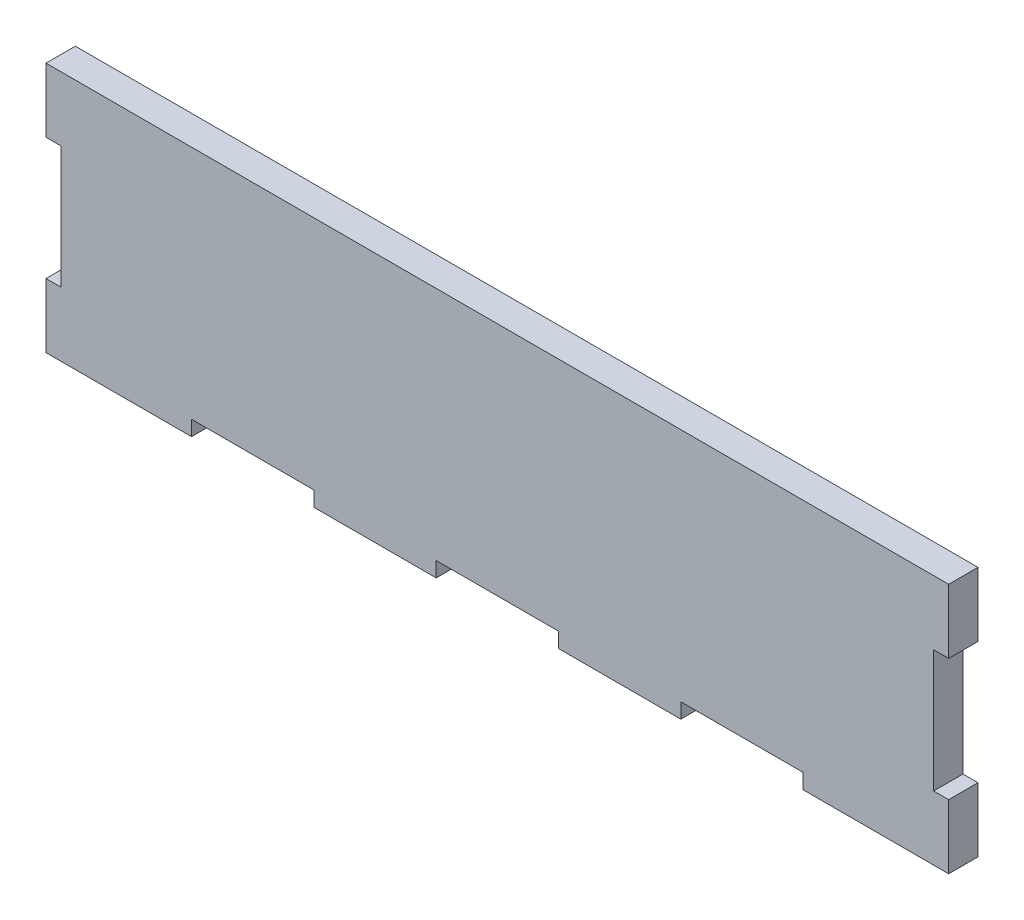
ISO-10303-21;
HEADER;
FILE_DESCRIPTION(('STEP AP214'),'2;1');
FILE_NAME('part.step','',(''),(''),'','','');
FILE_SCHEMA(('AUTOMOTIVE_DESIGN { 1 0 10303 214 1 1 1 1 }'));
ENDSEC;
DATA;
#1=APPLICATION_CONTEXT('core data for automotive mechanical design processes');
#2=APPLICATION_PROTOCOL_DEFINITION('international standard','automotive_design',2000,#1);
#3=PRODUCT_CONTEXT('',#1,'mechanical');
#4=PRODUCT('Part','Part','',(#3));
#5=PRODUCT_RELATED_PRODUCT_CATEGORY('part','',(#4));
#6=PRODUCT_DEFINITION_FORMATION('','',#4);
#7=PRODUCT_DEFINITION_CONTEXT('part definition',#1,'design');
#8=PRODUCT_DEFINITION('design','',#6,#7);
#9=PRODUCT_DEFINITION_SHAPE('','',#8);
#10=(LENGTH_UNIT() NAMED_UNIT(*) SI_UNIT(.MILLI.,.METRE.));
#11=(NAMED_UNIT(*) PLANE_ANGLE_UNIT() SI_UNIT($,.RADIAN.));
#12=(NAMED_UNIT(*) SI_UNIT($,.STERADIAN.) SOLID_ANGLE_UNIT());
#13=UNCERTAINTY_MEASURE_WITH_UNIT(LENGTH_MEASURE(1.E-05),#10,'distance_accuracy_value','');
#14=(GEOMETRIC_REPRESENTATION_CONTEXT(3) GLOBAL_UNCERTAINTY_ASSIGNED_CONTEXT((#13)) GLOBAL_UNIT_ASSIGNED_CONTEXT((#10,
#11,#12)) REPRESENTATION_CONTEXT('',''));
#15=CARTESIAN_POINT('',(0.,0.,0.));
#16=DIRECTION('',(0.,0.,1.));
#17=DIRECTION('',(1.,0.,0.));
#18=AXIS2_PLACEMENT_3D('',#15,#16,#17);
#19=CARTESIAN_POINT('',(180.,103.,5.85));
#20=DIRECTION('',(0.,-1.,0.));
#21=DIRECTION('',(0.,0.,-1.));
#22=AXIS2_PLACEMENT_3D('',#19,#20,#21);
#23=PLANE('',#22);
#24=DIRECTION('',(-1.,0.,0.));
#25=VECTOR('',#24,1.);
#26=CARTESIAN_POINT('',(180.,103.,0.));
#27=LINE('',#26,#25);
#28=CARTESIAN_POINT('',(180.,103.,0.));
#29=VERTEX_POINT('',#28);
#30=CARTESIAN_POINT('',(0.,103.,0.));
#31=VERTEX_POINT('',#30);
#32=EDGE_CURVE('E225',#29,#31,#27,.T.);
#33=ORIENTED_EDGE('',*,*,#32,.T.);
#34=DIRECTION('',(0.,0.,-1.));
#35=VECTOR('',#34,1.);
#36=CARTESIAN_POINT('',(0.,103.,5.85));
#37=LINE('',#36,#35);
#38=CARTESIAN_POINT('',(0.,103.,5.85));
#39=VERTEX_POINT('',#38);
#40=EDGE_CURVE('E11',#39,#31,#37,.T.);
#41=ORIENTED_EDGE('',*,*,#40,.F.);
#42=DIRECTION('',(-1.,0.,0.));
#43=VECTOR('',#42,1.);
#44=CARTESIAN_POINT('',(180.,103.,5.85));
#45=LINE('',#44,#43);
#46=CARTESIAN_POINT('',(180.,103.,5.85));
#47=VERTEX_POINT('',#46);
#48=EDGE_CURVE('E272',#47,#39,#45,.T.);
#49=ORIENTED_EDGE('',*,*,#48,.F.);
#50=DIRECTION('',(0.,0.,-1.));
#51=VECTOR('',#50,1.);
#52=CARTESIAN_POINT('',(180.,103.,5.85));
#53=LINE('',#52,#51);
#54=EDGE_CURVE('E221',#47,#29,#53,.T.);
#55=ORIENTED_EDGE('',*,*,#54,.T.);
#56=EDGE_LOOP('',(#33,#41,#49,#55));
#57=FACE_BOUND('',#56,.T.);
#58=ADVANCED_FACE('F33',(#57),#23,.F.);
#59=CARTESIAN_POINT('',(0.,103.,5.85));
#60=DIRECTION('',(1.,0.,0.));
#61=DIRECTION('',(0.,0.,-1.));
#62=AXIS2_PLACEMENT_3D('',#59,#60,#61);
#63=PLANE('',#62);
#64=DIRECTION('',(0.,-1.,0.));
#65=VECTOR('',#64,1.);
#66=CARTESIAN_POINT('',(0.,103.,0.));
#67=LINE('',#66,#65);
#68=CARTESIAN_POINT('',(0.,90.195,0.));
#69=VERTEX_POINT('',#68);
#70=EDGE_CURVE('E228',#31,#69,#67,.T.);
#71=ORIENTED_EDGE('',*,*,#70,.T.);
#72=DIRECTION('',(0.,0.,-1.));
#73=VECTOR('',#72,1.);
#74=CARTESIAN_POINT('',(0.,90.195,5.85));
#75=LINE('',#74,#73);
#76=CARTESIAN_POINT('',(0.,90.195,5.85));
#77=VERTEX_POINT('',#76);
#78=EDGE_CURVE('E41',#77,#69,#75,.T.);
#79=ORIENTED_EDGE('',*,*,#78,.F.);
#80=DIRECTION('',(0.,-1.,0.));
#81=VECTOR('',#80,1.);
#82=CARTESIAN_POINT('',(0.,103.,5.85));
#83=LINE('',#82,#81);
#84=EDGE_CURVE('E140',#39,#77,#83,.T.);
#85=ORIENTED_EDGE('',*,*,#84,.F.);
#86=ORIENTED_EDGE('',*,*,#40,.T.);
#87=EDGE_LOOP('',(#71,#79,#85,#86));
#88=FACE_BOUND('',#87,.T.);
#89=ADVANCED_FACE('F410',(#88),#63,.F.);
#90=CARTESIAN_POINT('',(0.,90.195,5.85));
#91=DIRECTION('',(0.,1.,0.));
#92=DIRECTION('',(0.,0.,1.));
#93=AXIS2_PLACEMENT_3D('',#90,#91,#92);
#94=PLANE('',#93);
#95=DIRECTION('',(1.,0.,0.));
#96=VECTOR('',#95,1.);
#97=CARTESIAN_POINT('',(0.,90.195,0.));
#98=LINE('',#97,#96);
#99=CARTESIAN_POINT('',(3.,90.195,0.));
#100=VERTEX_POINT('',#99);
#101=EDGE_CURVE('E230',#69,#100,#98,.T.);
#102=ORIENTED_EDGE('',*,*,#101,.T.);
#103=DIRECTION('',(0.,0.,-1.));
#104=VECTOR('',#103,1.);
#105=CARTESIAN_POINT('',(3.,90.195,5.85));
#106=LINE('',#105,#104);
#107=CARTESIAN_POINT('',(3.,90.195,5.85));
#108=VERTEX_POINT('',#107);
#109=EDGE_CURVE('E327',#108,#100,#106,.T.);
#110=ORIENTED_EDGE('',*,*,#109,.F.);
#111=DIRECTION('',(1.,0.,0.));
#112=VECTOR('',#111,1.);
#113=CARTESIAN_POINT('',(0.,90.195,5.85));
#114=LINE('',#113,#112);
#115=EDGE_CURVE('E335',#77,#108,#114,.T.);
#116=ORIENTED_EDGE('',*,*,#115,.F.);
#117=ORIENTED_EDGE('',*,*,#78,.T.);
#118=EDGE_LOOP('',(#102,#110,#116,#117));
#119=FACE_BOUND('',#118,.T.);
#120=ADVANCED_FACE('F333',(#119),#94,.F.);
#121=CARTESIAN_POINT('',(3.,90.195,5.85));
#122=DIRECTION('',(1.,0.,0.));
#123=DIRECTION('',(0.,0.,-1.));
#124=AXIS2_PLACEMENT_3D('',#121,#122,#123);
#125=PLANE('',#124);
#126=DIRECTION('',(0.,-1.,0.));
#127=VECTOR('',#126,1.);
#128=CARTESIAN_POINT('',(3.,90.195,0.));
#129=LINE('',#128,#127);
#130=CARTESIAN_POINT('',(3.,65.805,0.));
#131=VERTEX_POINT('',#130);
#132=EDGE_CURVE('E232',#100,#131,#129,.T.);
#133=ORIENTED_EDGE('',*,*,#132,.T.);
#134=DIRECTION('',(0.,0.,-1.));
#135=VECTOR('',#134,1.);
#136=CARTESIAN_POINT('',(3.,65.805,5.85));
#137=LINE('',#136,#135);
#138=CARTESIAN_POINT('',(3.,65.805,5.85));
#139=VERTEX_POINT('',#138);
#140=EDGE_CURVE('E324',#139,#131,#137,.T.);
#141=ORIENTED_EDGE('',*,*,#140,.F.);
#142=DIRECTION('',(0.,-1.,0.));
#143=VECTOR('',#142,1.);
#144=CARTESIAN_POINT('',(3.,90.195,5.85));
#145=LINE('',#144,#143);
#146=EDGE_CURVE('E353',#108,#139,#145,.T.);
#147=ORIENTED_EDGE('',*,*,#146,.F.);
#148=ORIENTED_EDGE('',*,*,#109,.T.);
#149=EDGE_LOOP('',(#133,#141,#147,#148));
#150=FACE_BOUND('',#149,.T.);
#151=ADVANCED_FACE('F344',(#150),#125,.F.);
#152=CARTESIAN_POINT('',(3.,65.805,5.85));
#153=DIRECTION('',(0.,-1.,0.));
#154=DIRECTION('',(0.,0.,-1.));
#155=AXIS2_PLACEMENT_3D('',#152,#153,#154);
#156=PLANE('',#155);
#157=DIRECTION('',(-1.,0.,0.));
#158=VECTOR('',#157,1.);
#159=CARTESIAN_POINT('',(3.,65.805,0.));
#160=LINE('',#159,#158);
#161=CARTESIAN_POINT('',(0.,65.805,0.));
#162=VERTEX_POINT('',#161);
#163=EDGE_CURVE('E234',#131,#162,#160,.T.);
#164=ORIENTED_EDGE('',*,*,#163,.T.);
#165=DIRECTION('',(0.,0.,-1.));
#166=VECTOR('',#165,1.);
#167=CARTESIAN_POINT('',(0.,65.805,5.85));
#168=LINE('',#167,#166);
#169=CARTESIAN_POINT('',(0.,65.805,5.85));
#170=VERTEX_POINT('',#169);
#171=EDGE_CURVE('E321',#170,#162,#168,.T.);
#172=ORIENTED_EDGE('',*,*,#171,.F.);
#173=DIRECTION('',(-1.,0.,0.));
#174=VECTOR('',#173,1.);
#175=CARTESIAN_POINT('',(3.,65.805,5.85));
#176=LINE('',#175,#174);
#177=EDGE_CURVE('E350',#139,#170,#176,.T.);
#178=ORIENTED_EDGE('',*,*,#177,.F.);
#179=ORIENTED_EDGE('',*,*,#140,.T.);
#180=EDGE_LOOP('',(#164,#172,#178,#179));
#181=FACE_BOUND('',#180,.T.);
#182=ADVANCED_FACE('F348',(#181),#156,.F.);
#183=CARTESIAN_POINT('',(0.,65.805,5.85));
#184=DIRECTION('',(1.,0.,0.));
#185=DIRECTION('',(0.,0.,-1.));
#186=AXIS2_PLACEMENT_3D('',#183,#184,#185);
#187=PLANE('',#186);
#188=DIRECTION('',(0.,-1.,0.));
#189=VECTOR('',#188,1.);
#190=CARTESIAN_POINT('',(0.,65.805,0.));
#191=LINE('',#190,#189);
#192=CARTESIAN_POINT('',(0.,53.,0.));
#193=VERTEX_POINT('',#192);
#194=EDGE_CURVE('E236',#162,#193,#191,.T.);
#195=ORIENTED_EDGE('',*,*,#194,.T.);
#196=DIRECTION('',(0.,0.,-1.));
#197=VECTOR('',#196,1.);
#198=CARTESIAN_POINT('',(0.,53.,5.85));
#199=LINE('',#198,#197);
#200=CARTESIAN_POINT('',(0.,53.,5.85));
#201=VERTEX_POINT('',#200);
#202=EDGE_CURVE('E318',#201,#193,#199,.T.);
#203=ORIENTED_EDGE('',*,*,#202,.F.);
#204=DIRECTION('',(0.,-1.,0.));
#205=VECTOR('',#204,1.);
#206=CARTESIAN_POINT('',(0.,65.805,5.85));
#207=LINE('',#206,#205);
#208=EDGE_CURVE('E352',#170,#201,#207,.T.);
#209=ORIENTED_EDGE('',*,*,#208,.F.);
#210=ORIENTED_EDGE('',*,*,#171,.T.);
#211=EDGE_LOOP('',(#195,#203,#209,#210));
#212=FACE_BOUND('',#211,.T.);
#213=ADVANCED_FACE('F423',(#212),#187,.F.);
#214=CARTESIAN_POINT('',(0.,53.,5.85));
#215=DIRECTION('',(0.,1.,0.));
#216=DIRECTION('',(0.,0.,1.));
#217=AXIS2_PLACEMENT_3D('',#214,#215,#216);
#218=PLANE('',#217);
#219=DIRECTION('',(1.,0.,0.));
#220=VECTOR('',#219,1.);
#221=CARTESIAN_POINT('',(0.,53.,0.));
#222=LINE('',#221,#220);
#223=CARTESIAN_POINT('',(29.025,53.,0.));
#224=VERTEX_POINT('',#223);
#225=EDGE_CURVE('E238',#193,#224,#222,.T.);
#226=ORIENTED_EDGE('',*,*,#225,.T.);
#227=DIRECTION('',(0.,0.,-1.));
#228=VECTOR('',#227,1.);
#229=CARTESIAN_POINT('',(29.025,53.,5.85));
#230=LINE('',#229,#228);
#231=CARTESIAN_POINT('',(29.025,53.,5.85));
#232=VERTEX_POINT('',#231);
#233=EDGE_CURVE('E315',#232,#224,#230,.T.);
#234=ORIENTED_EDGE('',*,*,#233,.F.);
#235=DIRECTION('',(1.,0.,0.));
#236=VECTOR('',#235,1.);
#237=CARTESIAN_POINT('',(0.,53.,5.85));
#238=LINE('',#237,#236);
#239=EDGE_CURVE('E355',#201,#232,#238,.T.);
#240=ORIENTED_EDGE('',*,*,#239,.F.);
#241=ORIENTED_EDGE('',*,*,#202,.T.);
#242=EDGE_LOOP('',(#226,#234,#240,#241));
#243=FACE_BOUND('',#242,.T.);
#244=ADVANCED_FACE('F426',(#243),#218,.F.);
#245=CARTESIAN_POINT('',(29.025,53.,5.85));
#246=DIRECTION('',(-1.,0.,0.));
#247=DIRECTION('',(0.,0.,1.));
#248=AXIS2_PLACEMENT_3D('',#245,#246,#247);
#249=PLANE('',#248);
#250=DIRECTION('',(0.,1.,0.));
#251=VECTOR('',#250,1.);
#252=CARTESIAN_POINT('',(29.025,53.,0.));
#253=LINE('',#252,#251);
#254=CARTESIAN_POINT('',(29.025,56.,0.));
#255=VERTEX_POINT('',#254);
#256=EDGE_CURVE('E240',#224,#255,#253,.T.);
#257=ORIENTED_EDGE('',*,*,#256,.T.);
#258=DIRECTION('',(0.,0.,-1.));
#259=VECTOR('',#258,1.);
#260=CARTESIAN_POINT('',(29.025,56.,5.85));
#261=LINE('',#260,#259);
#262=CARTESIAN_POINT('',(29.025,56.,5.85));
#263=VERTEX_POINT('',#262);
#264=EDGE_CURVE('E312',#263,#255,#261,.T.);
#265=ORIENTED_EDGE('',*,*,#264,.F.);
#266=DIRECTION('',(0.,1.,0.));
#267=VECTOR('',#266,1.);
#268=CARTESIAN_POINT('',(29.025,53.,5.85));
#269=LINE('',#268,#267);
#270=EDGE_CURVE('E361',#232,#263,#269,.T.);
#271=ORIENTED_EDGE('',*,*,#270,.F.);
#272=ORIENTED_EDGE('',*,*,#233,.T.);
#273=EDGE_LOOP('',(#257,#265,#271,#272));
#274=FACE_BOUND('',#273,.T.);
#275=ADVANCED_FACE('F430',(#274),#249,.F.);
#276=CARTESIAN_POINT('',(29.025,56.,5.85));
#277=DIRECTION('',(0.,1.,0.));
#278=DIRECTION('',(0.,0.,1.));
#279=AXIS2_PLACEMENT_3D('',#276,#277,#278);
#280=PLANE('',#279);
#281=DIRECTION('',(1.,0.,0.));
#282=VECTOR('',#281,1.);
#283=CARTESIAN_POINT('',(29.025,56.,0.));
#284=LINE('',#283,#282);
#285=CARTESIAN_POINT('',(53.415,56.,0.));
#286=VERTEX_POINT('',#285);
#287=EDGE_CURVE('E242',#255,#286,#284,.T.);
#288=ORIENTED_EDGE('',*,*,#287,.T.);
#289=DIRECTION('',(0.,0.,-1.));
#290=VECTOR('',#289,1.);
#291=CARTESIAN_POINT('',(53.415,56.,5.85));
#292=LINE('',#291,#290);
#293=CARTESIAN_POINT('',(53.415,56.,5.85));
#294=VERTEX_POINT('',#293);
#295=EDGE_CURVE('E309',#294,#286,#292,.T.);
#296=ORIENTED_EDGE('',*,*,#295,.F.);
#297=DIRECTION('',(1.,0.,0.));
#298=VECTOR('',#297,1.);
#299=CARTESIAN_POINT('',(29.025,56.,5.85));
#300=LINE('',#299,#298);
#301=EDGE_CURVE('E363',#263,#294,#300,.T.);
#302=ORIENTED_EDGE('',*,*,#301,.F.);
#303=ORIENTED_EDGE('',*,*,#264,.T.);
#304=EDGE_LOOP('',(#288,#296,#302,#303));
#305=FACE_BOUND('',#304,.T.);
#306=ADVANCED_FACE('F434',(#305),#280,.F.);
#307=CARTESIAN_POINT('',(53.415,56.,5.85));
#308=DIRECTION('',(1.,0.,0.));
#309=DIRECTION('',(0.,0.,-1.));
#310=AXIS2_PLACEMENT_3D('',#307,#308,#309);
#311=PLANE('',#310);
#312=DIRECTION('',(0.,-1.,0.));
#313=VECTOR('',#312,1.);
#314=CARTESIAN_POINT('',(53.415,56.,0.));
#315=LINE('',#314,#313);
#316=CARTESIAN_POINT('',(53.415,53.,0.));
#317=VERTEX_POINT('',#316);
#318=EDGE_CURVE('E244',#286,#317,#315,.T.);
#319=ORIENTED_EDGE('',*,*,#318,.T.);
#320=DIRECTION('',(0.,0.,-1.));
#321=VECTOR('',#320,1.);
#322=CARTESIAN_POINT('',(53.415,53.,5.85));
#323=LINE('',#322,#321);
#324=CARTESIAN_POINT('',(53.415,53.,5.85));
#325=VERTEX_POINT('',#324);
#326=EDGE_CURVE('E306',#325,#317,#323,.T.);
#327=ORIENTED_EDGE('',*,*,#326,.F.);
#328=DIRECTION('',(0.,-1.,0.));
#329=VECTOR('',#328,1.);
#330=CARTESIAN_POINT('',(53.415,56.,5.85));
#331=LINE('',#330,#329);
#332=EDGE_CURVE('E365',#294,#325,#331,.T.);
#333=ORIENTED_EDGE('',*,*,#332,.F.);
#334=ORIENTED_EDGE('',*,*,#295,.T.);
#335=EDGE_LOOP('',(#319,#327,#333,#334));
#336=FACE_BOUND('',#335,.T.);
#337=ADVANCED_FACE('F438',(#336),#311,.F.);
#338=CARTESIAN_POINT('',(53.415,53.,5.85));
#339=DIRECTION('',(0.,1.,0.));
#340=DIRECTION('',(0.,0.,1.));
#341=AXIS2_PLACEMENT_3D('',#338,#339,#340);
#342=PLANE('',#341);
#343=DIRECTION('',(1.,0.,0.));
#344=VECTOR('',#343,1.);
#345=CARTESIAN_POINT('',(53.415,53.,0.));
#346=LINE('',#345,#344);
#347=CARTESIAN_POINT('',(77.805,53.,0.));
#348=VERTEX_POINT('',#347);
#349=EDGE_CURVE('E246',#317,#348,#346,.T.);
#350=ORIENTED_EDGE('',*,*,#349,.T.);
#351=DIRECTION('',(0.,0.,-1.));
#352=VECTOR('',#351,1.);
#353=CARTESIAN_POINT('',(77.805,53.,5.85));
#354=LINE('',#353,#352);
#355=CARTESIAN_POINT('',(77.805,53.,5.85));
#356=VERTEX_POINT('',#355);
#357=EDGE_CURVE('E303',#356,#348,#354,.T.);
#358=ORIENTED_EDGE('',*,*,#357,.F.);
#359=DIRECTION('',(1.,0.,0.));
#360=VECTOR('',#359,1.);
#361=CARTESIAN_POINT('',(53.415,53.,5.85));
#362=LINE('',#361,#360);
#363=EDGE_CURVE('E367',#325,#356,#362,.T.);
#364=ORIENTED_EDGE('',*,*,#363,.F.);
#365=ORIENTED_EDGE('',*,*,#326,.T.);
#366=EDGE_LOOP('',(#350,#358,#364,#365));
#367=FACE_BOUND('',#366,.T.);
#368=ADVANCED_FACE('F442',(#367),#342,.F.);
#369=CARTESIAN_POINT('',(77.805,53.,5.85));
#370=DIRECTION('',(-1.,0.,0.));
#371=DIRECTION('',(0.,0.,1.));
#372=AXIS2_PLACEMENT_3D('',#369,#370,#371);
#373=PLANE('',#372);
#374=DIRECTION('',(0.,1.,0.));
#375=VECTOR('',#374,1.);
#376=CARTESIAN_POINT('',(77.805,53.,0.));
#377=LINE('',#376,#375);
#378=CARTESIAN_POINT('',(77.805,56.,0.));
#379=VERTEX_POINT('',#378);
#380=EDGE_CURVE('E248',#348,#379,#377,.T.);
#381=ORIENTED_EDGE('',*,*,#380,.T.);
#382=DIRECTION('',(0.,0.,-1.));
#383=VECTOR('',#382,1.);
#384=CARTESIAN_POINT('',(77.805,56.,5.85));
#385=LINE('',#384,#383);
#386=CARTESIAN_POINT('',(77.805,56.,5.85));
#387=VERTEX_POINT('',#386);
#388=EDGE_CURVE('E300',#387,#379,#385,.T.);
#389=ORIENTED_EDGE('',*,*,#388,.F.);
#390=DIRECTION('',(0.,1.,0.));
#391=VECTOR('',#390,1.);
#392=CARTESIAN_POINT('',(77.805,53.,5.85));
#393=LINE('',#392,#391);
#394=EDGE_CURVE('E369',#356,#387,#393,.T.);
#395=ORIENTED_EDGE('',*,*,#394,.F.);
#396=ORIENTED_EDGE('',*,*,#357,.T.);
#397=EDGE_LOOP('',(#381,#389,#395,#396));
#398=FACE_BOUND('',#397,.T.);
#399=ADVANCED_FACE('F446',(#398),#373,.F.);
#400=CARTESIAN_POINT('',(77.805,56.,5.85));
#401=DIRECTION('',(0.,1.,0.));
#402=DIRECTION('',(0.,0.,1.));
#403=AXIS2_PLACEMENT_3D('',#400,#401,#402);
#404=PLANE('',#403);
#405=DIRECTION('',(1.,0.,0.));
#406=VECTOR('',#405,1.);
#407=CARTESIAN_POINT('',(77.805,56.,0.));
#408=LINE('',#407,#406);
#409=CARTESIAN_POINT('',(102.195,56.,0.));
#410=VERTEX_POINT('',#409);
#411=EDGE_CURVE('E250',#379,#410,#408,.T.);
#412=ORIENTED_EDGE('',*,*,#411,.T.);
#413=DIRECTION('',(0.,0.,-1.));
#414=VECTOR('',#413,1.);
#415=CARTESIAN_POINT('',(102.195,56.,5.85));
#416=LINE('',#415,#414);
#417=CARTESIAN_POINT('',(102.195,56.,5.85));
#418=VERTEX_POINT('',#417);
#419=EDGE_CURVE('E297',#418,#410,#416,.T.);
#420=ORIENTED_EDGE('',*,*,#419,.F.);
#421=DIRECTION('',(1.,0.,0.));
#422=VECTOR('',#421,1.);
#423=CARTESIAN_POINT('',(77.805,56.,5.85));
#424=LINE('',#423,#422);
#425=EDGE_CURVE('E371',#387,#418,#424,.T.);
#426=ORIENTED_EDGE('',*,*,#425,.F.);
#427=ORIENTED_EDGE('',*,*,#388,.T.);
#428=EDGE_LOOP('',(#412,#420,#426,#427));
#429=FACE_BOUND('',#428,.T.);
#430=ADVANCED_FACE('F450',(#429),#404,.F.);
#431=CARTESIAN_POINT('',(102.195,56.,5.85));
#432=DIRECTION('',(1.,0.,0.));
#433=DIRECTION('',(0.,0.,-1.));
#434=AXIS2_PLACEMENT_3D('',#431,#432,#433);
#435=PLANE('',#434);
#436=DIRECTION('',(0.,-1.,0.));
#437=VECTOR('',#436,1.);
#438=CARTESIAN_POINT('',(102.195,56.,0.));
#439=LINE('',#438,#437);
#440=CARTESIAN_POINT('',(102.195,53.,0.));
#441=VERTEX_POINT('',#440);
#442=EDGE_CURVE('E252',#410,#441,#439,.T.);
#443=ORIENTED_EDGE('',*,*,#442,.T.);
#444=DIRECTION('',(0.,0.,-1.));
#445=VECTOR('',#444,1.);
#446=CARTESIAN_POINT('',(102.195,53.,5.85));
#447=LINE('',#446,#445);
#448=CARTESIAN_POINT('',(102.195,53.,5.85));
#449=VERTEX_POINT('',#448);
#450=EDGE_CURVE('E294',#449,#441,#447,.T.);
#451=ORIENTED_EDGE('',*,*,#450,.F.);
#452=DIRECTION('',(0.,-1.,0.));
#453=VECTOR('',#452,1.);
#454=CARTESIAN_POINT('',(102.195,56.,5.85));
#455=LINE('',#454,#453);
#456=EDGE_CURVE('E373',#418,#449,#455,.T.);
#457=ORIENTED_EDGE('',*,*,#456,.F.);
#458=ORIENTED_EDGE('',*,*,#419,.T.);
#459=EDGE_LOOP('',(#443,#451,#457,#458));
#460=FACE_BOUND('',#459,.T.);
#461=ADVANCED_FACE('F454',(#460),#435,.F.);
#462=CARTESIAN_POINT('',(102.195,53.,5.85));
#463=DIRECTION('',(0.,1.,0.));
#464=DIRECTION('',(0.,0.,1.));
#465=AXIS2_PLACEMENT_3D('',#462,#463,#464);
#466=PLANE('',#465);
#467=DIRECTION('',(1.,0.,0.));
#468=VECTOR('',#467,1.);
#469=CARTESIAN_POINT('',(102.195,53.,0.));
#470=LINE('',#469,#468);
#471=CARTESIAN_POINT('',(126.585,53.,0.));
#472=VERTEX_POINT('',#471);
#473=EDGE_CURVE('E254',#441,#472,#470,.T.);
#474=ORIENTED_EDGE('',*,*,#473,.T.);
#475=DIRECTION('',(0.,0.,-1.));
#476=VECTOR('',#475,1.);
#477=CARTESIAN_POINT('',(126.585,53.,5.85));
#478=LINE('',#477,#476);
#479=CARTESIAN_POINT('',(126.585,53.,5.85));
#480=VERTEX_POINT('',#479);
#481=EDGE_CURVE('E291',#480,#472,#478,.T.);
#482=ORIENTED_EDGE('',*,*,#481,.F.);
#483=DIRECTION('',(1.,0.,0.));
#484=VECTOR('',#483,1.);
#485=CARTESIAN_POINT('',(102.195,53.,5.85));
#486=LINE('',#485,#484);
#487=EDGE_CURVE('E375',#449,#480,#486,.T.);
#488=ORIENTED_EDGE('',*,*,#487,.F.);
#489=ORIENTED_EDGE('',*,*,#450,.T.);
#490=EDGE_LOOP('',(#474,#482,#488,#489));
#491=FACE_BOUND('',#490,.T.);
#492=ADVANCED_FACE('F458',(#491),#466,.F.);
#493=CARTESIAN_POINT('',(126.585,53.,5.85));
#494=DIRECTION('',(-1.,0.,0.));
#495=DIRECTION('',(0.,0.,1.));
#496=AXIS2_PLACEMENT_3D('',#493,#494,#495);
#497=PLANE('',#496);
#498=DIRECTION('',(0.,1.,0.));
#499=VECTOR('',#498,1.);
#500=CARTESIAN_POINT('',(126.585,53.,0.));
#501=LINE('',#500,#499);
#502=CARTESIAN_POINT('',(126.585,56.,0.));
#503=VERTEX_POINT('',#502);
#504=EDGE_CURVE('E256',#472,#503,#501,.T.);
#505=ORIENTED_EDGE('',*,*,#504,.T.);
#506=DIRECTION('',(0.,0.,-1.));
#507=VECTOR('',#506,1.);
#508=CARTESIAN_POINT('',(126.585,56.,5.85));
#509=LINE('',#508,#507);
#510=CARTESIAN_POINT('',(126.585,56.,5.85));
#511=VERTEX_POINT('',#510);
#512=EDGE_CURVE('E288',#511,#503,#509,.T.);
#513=ORIENTED_EDGE('',*,*,#512,.F.);
#514=DIRECTION('',(0.,1.,0.));
#515=VECTOR('',#514,1.);
#516=CARTESIAN_POINT('',(126.585,53.,5.85));
#517=LINE('',#516,#515);
#518=EDGE_CURVE('E377',#480,#511,#517,.T.);
#519=ORIENTED_EDGE('',*,*,#518,.F.);
#520=ORIENTED_EDGE('',*,*,#481,.T.);
#521=EDGE_LOOP('',(#505,#513,#519,#520));
#522=FACE_BOUND('',#521,.T.);
#523=ADVANCED_FACE('F462',(#522),#497,.F.);
#524=CARTESIAN_POINT('',(126.585,56.,5.85));
#525=DIRECTION('',(0.,1.,0.));
#526=DIRECTION('',(0.,0.,1.));
#527=AXIS2_PLACEMENT_3D('',#524,#525,#526);
#528=PLANE('',#527);
#529=DIRECTION('',(1.,0.,0.));
#530=VECTOR('',#529,1.);
#531=CARTESIAN_POINT('',(126.585,56.,0.));
#532=LINE('',#531,#530);
#533=CARTESIAN_POINT('',(150.975,56.,0.));
#534=VERTEX_POINT('',#533);
#535=EDGE_CURVE('E258',#503,#534,#532,.T.);
#536=ORIENTED_EDGE('',*,*,#535,.T.);
#537=DIRECTION('',(0.,0.,-1.));
#538=VECTOR('',#537,1.);
#539=CARTESIAN_POINT('',(150.975,56.,5.85));
#540=LINE('',#539,#538);
#541=CARTESIAN_POINT('',(150.975,56.,5.85));
#542=VERTEX_POINT('',#541);
#543=EDGE_CURVE('E285',#542,#534,#540,.T.);
#544=ORIENTED_EDGE('',*,*,#543,.F.);
#545=DIRECTION('',(1.,0.,0.));
#546=VECTOR('',#545,1.);
#547=CARTESIAN_POINT('',(126.585,56.,5.85));
#548=LINE('',#547,#546);
#549=EDGE_CURVE('E379',#511,#542,#548,.T.);
#550=ORIENTED_EDGE('',*,*,#549,.F.);
#551=ORIENTED_EDGE('',*,*,#512,.T.);
#552=EDGE_LOOP('',(#536,#544,#550,#551));
#553=FACE_BOUND('',#552,.T.);
#554=ADVANCED_FACE('F466',(#553),#528,.F.);
#555=CARTESIAN_POINT('',(150.975,56.,5.85));
#556=DIRECTION('',(1.,0.,0.));
#557=DIRECTION('',(0.,0.,-1.));
#558=AXIS2_PLACEMENT_3D('',#555,#556,#557);
#559=PLANE('',#558);
#560=DIRECTION('',(0.,-1.,0.));
#561=VECTOR('',#560,1.);
#562=CARTESIAN_POINT('',(150.975,56.,0.));
#563=LINE('',#562,#561);
#564=CARTESIAN_POINT('',(150.975,53.,0.));
#565=VERTEX_POINT('',#564);
#566=EDGE_CURVE('E260',#534,#565,#563,.T.);
#567=ORIENTED_EDGE('',*,*,#566,.T.);
#568=DIRECTION('',(0.,0.,-1.));
#569=VECTOR('',#568,1.);
#570=CARTESIAN_POINT('',(150.975,53.,5.85));
#571=LINE('',#570,#569);
#572=CARTESIAN_POINT('',(150.975,53.,5.85));
#573=VERTEX_POINT('',#572);
#574=EDGE_CURVE('E282',#573,#565,#571,.T.);
#575=ORIENTED_EDGE('',*,*,#574,.F.);
#576=DIRECTION('',(0.,-1.,0.));
#577=VECTOR('',#576,1.);
#578=CARTESIAN_POINT('',(150.975,56.,5.85));
#579=LINE('',#578,#577);
#580=EDGE_CURVE('E381',#542,#573,#579,.T.);
#581=ORIENTED_EDGE('',*,*,#580,.F.);
#582=ORIENTED_EDGE('',*,*,#543,.T.);
#583=EDGE_LOOP('',(#567,#575,#581,#582));
#584=FACE_BOUND('',#583,.T.);
#585=ADVANCED_FACE('F470',(#584),#559,.F.);
#586=CARTESIAN_POINT('',(175.365,53.,5.85));
#587=DIRECTION('',(0.,1.,0.));
#588=DIRECTION('',(0.,0.,1.));
#589=AXIS2_PLACEMENT_3D('',#586,#587,#588);
#590=PLANE('',#589);
#591=DIRECTION('',(1.,0.,0.));
#592=VECTOR('',#591,1.);
#593=CARTESIAN_POINT('',(175.365,53.,0.));
#594=LINE('',#593,#592);
#595=CARTESIAN_POINT('',(180.,53.,0.));
#596=VERTEX_POINT('',#595);
#597=EDGE_CURVE('E263',#565,#596,#594,.T.);
#598=ORIENTED_EDGE('',*,*,#597,.T.);
#599=DIRECTION('',(0.,0.,-1.));
#600=VECTOR('',#599,1.);
#601=CARTESIAN_POINT('',(180.,53.,5.85));
#602=LINE('',#601,#600);
#603=CARTESIAN_POINT('',(180.,53.,5.85));
#604=VERTEX_POINT('',#603);
#605=EDGE_CURVE('E279',#604,#596,#602,.T.);
#606=ORIENTED_EDGE('',*,*,#605,.F.);
#607=DIRECTION('',(1.,0.,0.));
#608=VECTOR('',#607,1.);
#609=CARTESIAN_POINT('',(150.975,53.,5.85));
#610=LINE('',#609,#608);
#611=EDGE_CURVE('E383',#573,#604,#610,.T.);
#612=ORIENTED_EDGE('',*,*,#611,.F.);
#613=ORIENTED_EDGE('',*,*,#574,.T.);
#614=EDGE_LOOP('',(#598,#606,#612,#613));
#615=FACE_BOUND('',#614,.T.);
#616=ADVANCED_FACE('F474',(#615),#590,.F.);
#617=CARTESIAN_POINT('',(180.,53.,5.85));
#618=DIRECTION('',(-1.,0.,0.));
#619=DIRECTION('',(0.,0.,1.));
#620=AXIS2_PLACEMENT_3D('',#617,#618,#619);
#621=PLANE('',#620);
#622=DIRECTION('',(0.,1.,0.));
#623=VECTOR('',#622,1.);
#624=CARTESIAN_POINT('',(180.,53.,0.));
#625=LINE('',#624,#623);
#626=CARTESIAN_POINT('',(180.,65.805,0.));
#627=VERTEX_POINT('',#626);
#628=EDGE_CURVE('E265',#596,#627,#625,.T.);
#629=ORIENTED_EDGE('',*,*,#628,.T.);
#630=DIRECTION('',(0.,0.,-1.));
#631=VECTOR('',#630,1.);
#632=CARTESIAN_POINT('',(180.,65.805,5.85));
#633=LINE('',#632,#631);
#634=CARTESIAN_POINT('',(180.,65.805,5.85));
#635=VERTEX_POINT('',#634);
#636=EDGE_CURVE('E276',#635,#627,#633,.T.);
#637=ORIENTED_EDGE('',*,*,#636,.F.);
#638=DIRECTION('',(0.,1.,0.));
#639=VECTOR('',#638,1.);
#640=CARTESIAN_POINT('',(180.,53.,5.85));
#641=LINE('',#640,#639);
#642=EDGE_CURVE('E385',#604,#635,#641,.T.);
#643=ORIENTED_EDGE('',*,*,#642,.F.);
#644=ORIENTED_EDGE('',*,*,#605,.T.);
#645=EDGE_LOOP('',(#629,#637,#643,#644));
#646=FACE_BOUND('',#645,.T.);
#647=ADVANCED_FACE('F391',(#646),#621,.F.);
#648=CARTESIAN_POINT('',(180.,65.805,5.85));
#649=DIRECTION('',(0.,-1.,0.));
#650=DIRECTION('',(0.,0.,-1.));
#651=AXIS2_PLACEMENT_3D('',#648,#649,#650);
#652=PLANE('',#651);
#653=DIRECTION('',(-1.,0.,0.));
#654=VECTOR('',#653,1.);
#655=CARTESIAN_POINT('',(180.,65.805,0.));
#656=LINE('',#655,#654);
#657=CARTESIAN_POINT('',(177.,65.805,0.));
#658=VERTEX_POINT('',#657);
#659=EDGE_CURVE('E267',#627,#658,#656,.T.);
#660=ORIENTED_EDGE('',*,*,#659,.T.);
#661=DIRECTION('',(0.,0.,-1.));
#662=VECTOR('',#661,1.);
#663=CARTESIAN_POINT('',(177.,65.805,5.85));
#664=LINE('',#663,#662);
#665=CARTESIAN_POINT('',(177.,65.805,5.85));
#666=VERTEX_POINT('',#665);
#667=EDGE_CURVE('E216',#666,#658,#664,.T.);
#668=ORIENTED_EDGE('',*,*,#667,.F.);
#669=DIRECTION('',(-1.,0.,0.));
#670=VECTOR('',#669,1.);
#671=CARTESIAN_POINT('',(180.,65.805,5.85));
#672=LINE('',#671,#670);
#673=EDGE_CURVE('E207',#635,#666,#672,.T.);
#674=ORIENTED_EDGE('',*,*,#673,.F.);
#675=ORIENTED_EDGE('',*,*,#636,.T.);
#676=EDGE_LOOP('',(#660,#668,#674,#675));
#677=FACE_BOUND('',#676,.T.);
#678=ADVANCED_FACE('F395',(#677),#652,.F.);
#679=CARTESIAN_POINT('',(177.,65.805,5.85));
#680=DIRECTION('',(-1.,0.,0.));
#681=DIRECTION('',(0.,0.,1.));
#682=AXIS2_PLACEMENT_3D('',#679,#680,#681);
#683=PLANE('',#682);
#684=DIRECTION('',(0.,1.,0.));
#685=VECTOR('',#684,1.);
#686=CARTESIAN_POINT('',(177.,65.805,0.));
#687=LINE('',#686,#685);
#688=CARTESIAN_POINT('',(177.,90.195,0.));
#689=VERTEX_POINT('',#688);
#690=EDGE_CURVE('E215',#658,#689,#687,.T.);
#691=ORIENTED_EDGE('',*,*,#690,.T.);
#692=DIRECTION('',(0.,0.,-1.));
#693=VECTOR('',#692,1.);
#694=CARTESIAN_POINT('',(177.,90.195,5.85));
#695=LINE('',#694,#693);
#696=CARTESIAN_POINT('',(177.,90.195,5.85));
#697=VERTEX_POINT('',#696);
#698=EDGE_CURVE('E212',#697,#689,#695,.T.);
#699=ORIENTED_EDGE('',*,*,#698,.F.);
#700=DIRECTION('',(0.,1.,0.));
#701=VECTOR('',#700,1.);
#702=CARTESIAN_POINT('',(177.,65.805,5.85));
#703=LINE('',#702,#701);
#704=EDGE_CURVE('E201',#666,#697,#703,.T.);
#705=ORIENTED_EDGE('',*,*,#704,.F.);
#706=ORIENTED_EDGE('',*,*,#667,.T.);
#707=EDGE_LOOP('',(#691,#699,#705,#706));
#708=FACE_BOUND('',#707,.T.);
#709=ADVANCED_FACE('F213',(#708),#683,.F.);
#710=CARTESIAN_POINT('',(177.,90.195,5.85));
#711=DIRECTION('',(0.,1.,0.));
#712=DIRECTION('',(0.,0.,1.));
#713=AXIS2_PLACEMENT_3D('',#710,#711,#712);
#714=PLANE('',#713);
#715=DIRECTION('',(1.,0.,0.));
#716=VECTOR('',#715,1.);
#717=CARTESIAN_POINT('',(177.,90.195,0.));
#718=LINE('',#717,#716);
#719=CARTESIAN_POINT('',(180.,90.195,0.));
#720=VERTEX_POINT('',#719);
#721=EDGE_CURVE('E126',#689,#720,#718,.T.);
#722=ORIENTED_EDGE('',*,*,#721,.T.);
#723=DIRECTION('',(0.,0.,-1.));
#724=VECTOR('',#723,1.);
#725=CARTESIAN_POINT('',(180.,90.195,5.85));
#726=LINE('',#725,#724);
#727=CARTESIAN_POINT('',(180.,90.195,5.85));
#728=VERTEX_POINT('',#727);
#729=EDGE_CURVE('E217',#728,#720,#726,.T.);
#730=ORIENTED_EDGE('',*,*,#729,.F.);
#731=DIRECTION('',(1.,0.,0.));
#732=VECTOR('',#731,1.);
#733=CARTESIAN_POINT('',(177.,90.195,5.85));
#734=LINE('',#733,#732);
#735=EDGE_CURVE('E205',#697,#728,#734,.T.);
#736=ORIENTED_EDGE('',*,*,#735,.F.);
#737=ORIENTED_EDGE('',*,*,#698,.T.);
#738=EDGE_LOOP('',(#722,#730,#736,#737));
#739=FACE_BOUND('',#738,.T.);
#740=ADVANCED_FACE('F219',(#739),#714,.F.);
#741=CARTESIAN_POINT('',(180.,90.195,5.85));
#742=DIRECTION('',(-1.,0.,0.));
#743=DIRECTION('',(0.,0.,1.));
#744=AXIS2_PLACEMENT_3D('',#741,#742,#743);
#745=PLANE('',#744);
#746=DIRECTION('',(0.,1.,0.));
#747=VECTOR('',#746,1.);
#748=CARTESIAN_POINT('',(180.,90.195,0.));
#749=LINE('',#748,#747);
#750=EDGE_CURVE('E132',#720,#29,#749,.T.);
#751=ORIENTED_EDGE('',*,*,#750,.T.);
#752=ORIENTED_EDGE('',*,*,#54,.F.);
#753=DIRECTION('',(0.,1.,0.));
#754=VECTOR('',#753,1.);
#755=CARTESIAN_POINT('',(180.,90.195,5.85));
#756=LINE('',#755,#754);
#757=EDGE_CURVE('E49',#728,#47,#756,.T.);
#758=ORIENTED_EDGE('',*,*,#757,.F.);
#759=ORIENTED_EDGE('',*,*,#729,.T.);
#760=EDGE_LOOP('',(#751,#752,#758,#759));
#761=FACE_BOUND('',#760,.T.);
#762=ADVANCED_FACE('F399',(#761),#745,.F.);
#763=CARTESIAN_POINT('',(0.,0.,5.85));
#764=DIRECTION('',(0.,0.,1.));
#765=DIRECTION('',(1.,0.,0.));
#766=AXIS2_PLACEMENT_3D('',#763,#764,#765);
#767=PLANE('',#766);
#768=ORIENTED_EDGE('',*,*,#48,.T.);
#769=ORIENTED_EDGE('',*,*,#84,.T.);
#770=ORIENTED_EDGE('',*,*,#115,.T.);
#771=ORIENTED_EDGE('',*,*,#146,.T.);
#772=ORIENTED_EDGE('',*,*,#177,.T.);
#773=ORIENTED_EDGE('',*,*,#208,.T.);
#774=ORIENTED_EDGE('',*,*,#239,.T.);
#775=ORIENTED_EDGE('',*,*,#270,.T.);
#776=ORIENTED_EDGE('',*,*,#301,.T.);
#777=ORIENTED_EDGE('',*,*,#332,.T.);
#778=ORIENTED_EDGE('',*,*,#363,.T.);
#779=ORIENTED_EDGE('',*,*,#394,.T.);
#780=ORIENTED_EDGE('',*,*,#425,.T.);
#781=ORIENTED_EDGE('',*,*,#456,.T.);
#782=ORIENTED_EDGE('',*,*,#487,.T.);
#783=ORIENTED_EDGE('',*,*,#518,.T.);
#784=ORIENTED_EDGE('',*,*,#549,.T.);
#785=ORIENTED_EDGE('',*,*,#580,.T.);
#786=ORIENTED_EDGE('',*,*,#611,.T.);
#787=ORIENTED_EDGE('',*,*,#642,.T.);
#788=ORIENTED_EDGE('',*,*,#673,.T.);
#789=ORIENTED_EDGE('',*,*,#704,.T.);
#790=ORIENTED_EDGE('',*,*,#735,.T.);
#791=ORIENTED_EDGE('',*,*,#757,.T.);
#792=EDGE_LOOP('',(#768,#769,#770,#771,#772,#773,#774,#775,#776,#777,#778,#779,#780,#781,#782,
#783,#784,#785,#786,#787,#788,#789,#790,#791));
#793=FACE_BOUND('',#792,.T.);
#794=ADVANCED_FACE('F203',(#793),#767,.T.);
#795=CARTESIAN_POINT('',(0.,0.,0.));
#796=DIRECTION('',(0.,0.,1.));
#797=DIRECTION('',(1.,0.,0.));
#798=AXIS2_PLACEMENT_3D('',#795,#796,#797);
#799=PLANE('',#798);
#800=ORIENTED_EDGE('',*,*,#32,.F.);
#801=ORIENTED_EDGE('',*,*,#750,.F.);
#802=ORIENTED_EDGE('',*,*,#721,.F.);
#803=ORIENTED_EDGE('',*,*,#690,.F.);
#804=ORIENTED_EDGE('',*,*,#659,.F.);
#805=ORIENTED_EDGE('',*,*,#628,.F.);
#806=ORIENTED_EDGE('',*,*,#597,.F.);
#807=ORIENTED_EDGE('',*,*,#566,.F.);
#808=ORIENTED_EDGE('',*,*,#535,.F.);
#809=ORIENTED_EDGE('',*,*,#504,.F.);
#810=ORIENTED_EDGE('',*,*,#473,.F.);
#811=ORIENTED_EDGE('',*,*,#442,.F.);
#812=ORIENTED_EDGE('',*,*,#411,.F.);
#813=ORIENTED_EDGE('',*,*,#380,.F.);
#814=ORIENTED_EDGE('',*,*,#349,.F.);
#815=ORIENTED_EDGE('',*,*,#318,.F.);
#816=ORIENTED_EDGE('',*,*,#287,.F.);
#817=ORIENTED_EDGE('',*,*,#256,.F.);
#818=ORIENTED_EDGE('',*,*,#225,.F.);
#819=ORIENTED_EDGE('',*,*,#194,.F.);
#820=ORIENTED_EDGE('',*,*,#163,.F.);
#821=ORIENTED_EDGE('',*,*,#132,.F.);
#822=ORIENTED_EDGE('',*,*,#101,.F.);
#823=ORIENTED_EDGE('',*,*,#70,.F.);
#824=EDGE_LOOP('',(#800,#801,#802,#803,#804,#805,#806,#807,#808,#809,#810,#811,#812,#813,#814,
#815,#816,#817,#818,#819,#820,#821,#822,#823));
#825=FACE_BOUND('',#824,.T.);
#826=ADVANCED_FACE('F339',(#825),#799,.F.);
#827=CLOSED_SHELL('',(#58,#89,#120,#151,#182,#213,#244,#275,#306,#337,#368,#399,#430,#461,#492,
#523,#554,#585,#616,#647,#678,#709,#740,#762,#794,#826));
#828=MANIFOLD_SOLID_BREP('B2',#827);
#829=ADVANCED_BREP_SHAPE_REPRESENTATION('',(#18,#828),#14);
#830=SHAPE_DEFINITION_REPRESENTATION(#9,#829);
ENDSEC;
END-ISO-10303-21;
